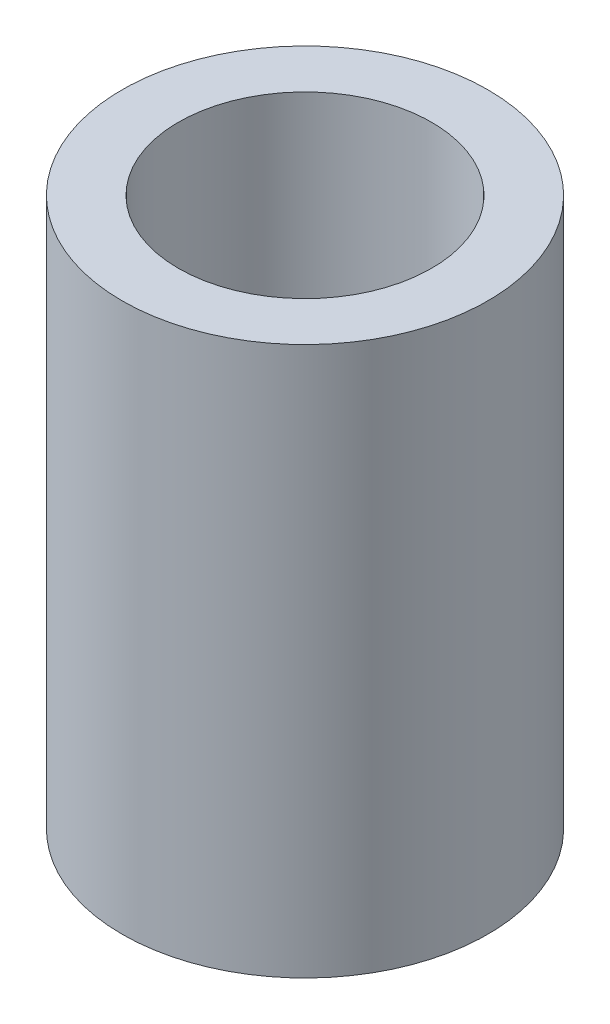
ISO-10303-21;
HEADER;
FILE_DESCRIPTION(('STEP AP214'),'2;1');
FILE_NAME('part.step','',(''),(''),'','','');
FILE_SCHEMA(('AUTOMOTIVE_DESIGN { 1 0 10303 214 1 1 1 1 }'));
ENDSEC;
DATA;
#1=APPLICATION_CONTEXT('core data for automotive mechanical design processes');
#2=APPLICATION_PROTOCOL_DEFINITION('international standard','automotive_design',2000,#1);
#3=PRODUCT_CONTEXT('',#1,'mechanical');
#4=PRODUCT('Part','Part','',(#3));
#5=PRODUCT_RELATED_PRODUCT_CATEGORY('part','',(#4));
#6=PRODUCT_DEFINITION_FORMATION('','',#4);
#7=PRODUCT_DEFINITION_CONTEXT('part definition',#1,'design');
#8=PRODUCT_DEFINITION('design','',#6,#7);
#9=PRODUCT_DEFINITION_SHAPE('','',#8);
#10=(LENGTH_UNIT() NAMED_UNIT(*) SI_UNIT(.MILLI.,.METRE.));
#11=(NAMED_UNIT(*) PLANE_ANGLE_UNIT() SI_UNIT($,.RADIAN.));
#12=(NAMED_UNIT(*) SI_UNIT($,.STERADIAN.) SOLID_ANGLE_UNIT());
#13=UNCERTAINTY_MEASURE_WITH_UNIT(LENGTH_MEASURE(1.E-05),#10,'distance_accuracy_value','');
#14=(GEOMETRIC_REPRESENTATION_CONTEXT(3) GLOBAL_UNCERTAINTY_ASSIGNED_CONTEXT((#13)) GLOBAL_UNIT_ASSIGNED_CONTEXT((#10,
#11,#12)) REPRESENTATION_CONTEXT('',''));
#15=CARTESIAN_POINT('',(0.,0.,0.));
#16=DIRECTION('',(0.,0.,1.));
#17=DIRECTION('',(1.,0.,0.));
#18=AXIS2_PLACEMENT_3D('',#15,#16,#17);
#19=CARTESIAN_POINT('',(0.,19.5,0.));
#20=DIRECTION('',(0.,1.,0.));
#21=DIRECTION('',(0.,0.,1.));
#22=AXIS2_PLACEMENT_3D('',#19,#20,#21);
#23=PLANE('',#22);
#24=CARTESIAN_POINT('',(0.,19.5,0.));
#25=DIRECTION('',(0.,1.,0.));
#26=DIRECTION('',(0.,0.,1.));
#27=AXIS2_PLACEMENT_3D('',#24,#25,#26);
#28=CIRCLE('',#27,6.5);
#29=CARTESIAN_POINT('',(0.,19.5,6.5));
#30=VERTEX_POINT('',#29);
#31=EDGE_CURVE('E10',#30,#30,#28,.T.);
#32=ORIENTED_EDGE('',*,*,#31,.T.);
#33=EDGE_LOOP('',(#32));
#34=FACE_BOUND('',#33,.T.);
#35=CARTESIAN_POINT('',(0.,19.5,0.));
#36=DIRECTION('',(0.,1.,0.));
#37=DIRECTION('',(0.,0.,1.));
#38=AXIS2_PLACEMENT_3D('',#35,#36,#37);
#39=CIRCLE('',#38,4.5);
#40=CARTESIAN_POINT('',(0.,19.5,4.5));
#41=VERTEX_POINT('',#40);
#42=EDGE_CURVE('E42',#41,#41,#39,.T.);
#43=ORIENTED_EDGE('',*,*,#42,.F.);
#44=EDGE_LOOP('',(#43));
#45=FACE_BOUND('',#44,.T.);
#46=ADVANCED_FACE('F31',(#34,#45),#23,.T.);
#47=CARTESIAN_POINT('',(0.,0.,0.));
#48=DIRECTION('',(0.,1.,0.));
#49=DIRECTION('',(0.,0.,1.));
#50=AXIS2_PLACEMENT_3D('',#47,#48,#49);
#51=PLANE('',#50);
#52=CARTESIAN_POINT('',(0.,0.,0.));
#53=DIRECTION('',(0.,1.,0.));
#54=DIRECTION('',(0.,0.,1.));
#55=AXIS2_PLACEMENT_3D('',#52,#53,#54);
#56=CIRCLE('',#55,6.5);
#57=CARTESIAN_POINT('',(0.,0.,6.5));
#58=VERTEX_POINT('',#57);
#59=EDGE_CURVE('E35',#58,#58,#56,.T.);
#60=ORIENTED_EDGE('',*,*,#59,.F.);
#61=EDGE_LOOP('',(#60));
#62=FACE_BOUND('',#61,.T.);
#63=CARTESIAN_POINT('',(0.,0.,0.));
#64=DIRECTION('',(0.,1.,0.));
#65=DIRECTION('',(0.,0.,1.));
#66=AXIS2_PLACEMENT_3D('',#63,#64,#65);
#67=CIRCLE('',#66,4.5);
#68=CARTESIAN_POINT('',(0.,0.,4.5));
#69=VERTEX_POINT('',#68);
#70=EDGE_CURVE('E44',#69,#69,#67,.T.);
#71=ORIENTED_EDGE('',*,*,#70,.T.);
#72=EDGE_LOOP('',(#71));
#73=FACE_BOUND('',#72,.T.);
#74=ADVANCED_FACE('F54',(#62,#73),#51,.F.);
#75=CARTESIAN_POINT('',(0.,19.5,0.));
#76=DIRECTION('',(0.,-1.,0.));
#77=DIRECTION('',(0.,0.,-1.));
#78=AXIS2_PLACEMENT_3D('',#75,#76,#77);
#79=CYLINDRICAL_SURFACE('',#78,6.5);
#80=ORIENTED_EDGE('',*,*,#31,.F.);
#81=EDGE_LOOP('',(#80));
#82=FACE_BOUND('',#81,.T.);
#83=ORIENTED_EDGE('',*,*,#59,.T.);
#84=EDGE_LOOP('',(#83));
#85=FACE_BOUND('',#84,.T.);
#86=ADVANCED_FACE('F33',(#82,#85),#79,.T.);
#87=CARTESIAN_POINT('',(0.,19.5,0.));
#88=DIRECTION('',(0.,-1.,0.));
#89=DIRECTION('',(0.,0.,-1.));
#90=AXIS2_PLACEMENT_3D('',#87,#88,#89);
#91=CYLINDRICAL_SURFACE('',#90,4.5);
#92=ORIENTED_EDGE('',*,*,#42,.T.);
#93=EDGE_LOOP('',(#92));
#94=FACE_BOUND('',#93,.T.);
#95=ORIENTED_EDGE('',*,*,#70,.F.);
#96=EDGE_LOOP('',(#95));
#97=FACE_BOUND('',#96,.T.);
#98=ADVANCED_FACE('F50',(#94,#97),#91,.F.);
#99=CLOSED_SHELL('',(#46,#74,#86,#98));
#100=MANIFOLD_SOLID_BREP('B2',#99);
#101=ADVANCED_BREP_SHAPE_REPRESENTATION('',(#18,#100),#14);
#102=SHAPE_DEFINITION_REPRESENTATION(#9,#101);
ENDSEC;
END-ISO-10303-21;
